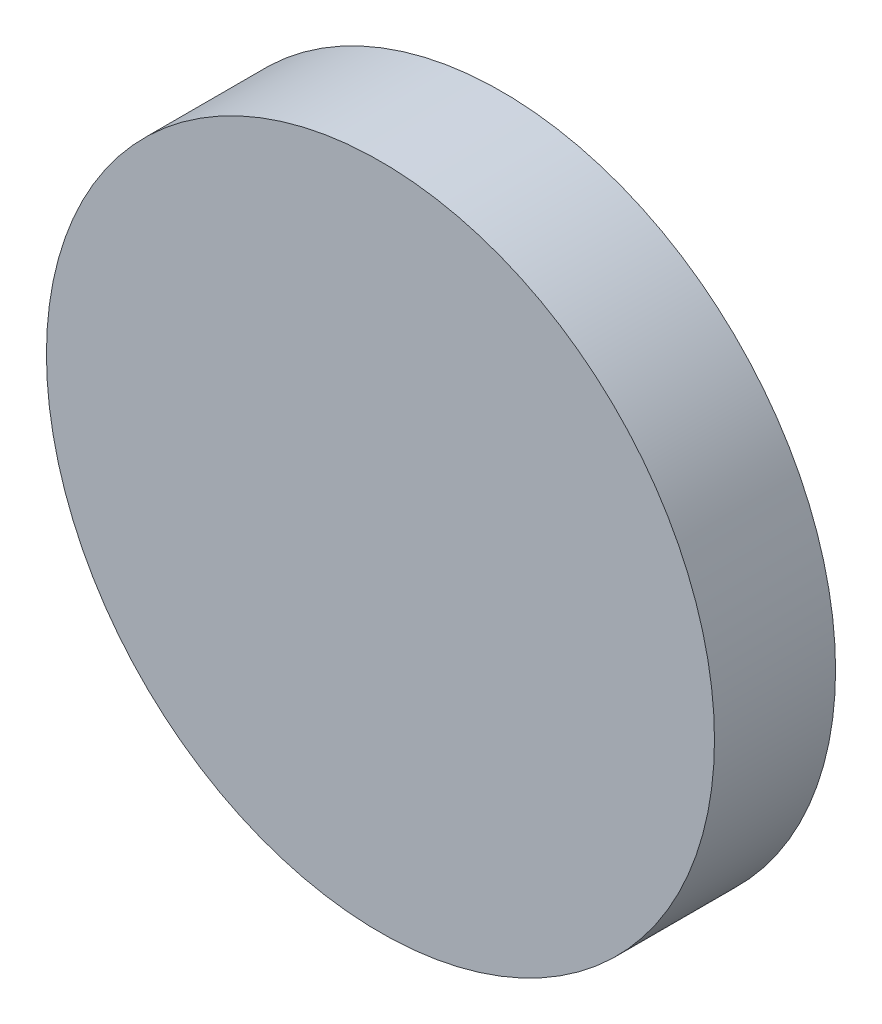
ISO-10303-21;
HEADER;
FILE_DESCRIPTION(('STEP AP214'),'2;1');
FILE_NAME('part.step','',(''),(''),'','','');
FILE_SCHEMA(('AUTOMOTIVE_DESIGN { 1 0 10303 214 1 1 1 1 }'));
ENDSEC;
DATA;
#1=APPLICATION_CONTEXT('core data for automotive mechanical design processes');
#2=APPLICATION_PROTOCOL_DEFINITION('international standard','automotive_design',2000,#1);
#3=PRODUCT_CONTEXT('',#1,'mechanical');
#4=PRODUCT('Part','Part','',(#3));
#5=PRODUCT_RELATED_PRODUCT_CATEGORY('part','',(#4));
#6=PRODUCT_DEFINITION_FORMATION('','',#4);
#7=PRODUCT_DEFINITION_CONTEXT('part definition',#1,'design');
#8=PRODUCT_DEFINITION('design','',#6,#7);
#9=PRODUCT_DEFINITION_SHAPE('','',#8);
#10=(LENGTH_UNIT() NAMED_UNIT(*) SI_UNIT(.MILLI.,.METRE.));
#11=(NAMED_UNIT(*) PLANE_ANGLE_UNIT() SI_UNIT($,.RADIAN.));
#12=(NAMED_UNIT(*) SI_UNIT($,.STERADIAN.) SOLID_ANGLE_UNIT());
#13=UNCERTAINTY_MEASURE_WITH_UNIT(LENGTH_MEASURE(1.E-05),#10,'distance_accuracy_value','');
#14=(GEOMETRIC_REPRESENTATION_CONTEXT(3) GLOBAL_UNCERTAINTY_ASSIGNED_CONTEXT((#13)) GLOBAL_UNIT_ASSIGNED_CONTEXT((#10,
#11,#12)) REPRESENTATION_CONTEXT('',''));
#15=CARTESIAN_POINT('',(0.,0.,0.));
#16=DIRECTION('',(0.,0.,1.));
#17=DIRECTION('',(1.,0.,0.));
#18=AXIS2_PLACEMENT_3D('',#15,#16,#17);
#19=CARTESIAN_POINT('',(-6.39539027108266,2.92873012414066,10.));
#20=DIRECTION('',(0.,0.,-1.));
#21=DIRECTION('',(-1.,0.,0.));
#22=AXIS2_PLACEMENT_3D('',#19,#20,#21);
#23=CYLINDRICAL_SURFACE('',#22,27.5857825998471);
#24=CARTESIAN_POINT('',(-6.39539027108266,2.92873012414066,10.));
#25=DIRECTION('',(0.,0.,1.));
#26=DIRECTION('',(1.,0.,0.));
#27=AXIS2_PLACEMENT_3D('',#24,#25,#26);
#28=CIRCLE('',#27,27.5857825998471);
#29=CARTESIAN_POINT('',(21.1903923287644,2.92873012414066,10.));
#30=VERTEX_POINT('',#29);
#31=EDGE_CURVE('E10',#30,#30,#28,.T.);
#32=ORIENTED_EDGE('',*,*,#31,.F.);
#33=EDGE_LOOP('',(#32));
#34=FACE_BOUND('',#33,.T.);
#35=CARTESIAN_POINT('',(-6.39539027108266,2.92873012414066,0.));
#36=DIRECTION('',(0.,0.,1.));
#37=DIRECTION('',(1.,0.,0.));
#38=AXIS2_PLACEMENT_3D('',#35,#36,#37);
#39=CIRCLE('',#38,27.5857825998471);
#40=CARTESIAN_POINT('',(21.1903923287644,2.92873012414066,0.));
#41=VERTEX_POINT('',#40);
#42=EDGE_CURVE('E40',#41,#41,#39,.T.);
#43=ORIENTED_EDGE('',*,*,#42,.T.);
#44=EDGE_LOOP('',(#43));
#45=FACE_BOUND('',#44,.T.);
#46=ADVANCED_FACE('F37',(#34,#45),#23,.T.);
#47=CARTESIAN_POINT('',(-6.39539027108266,2.92873012414066,10.));
#48=DIRECTION('',(0.,0.,1.));
#49=DIRECTION('',(1.,0.,0.));
#50=AXIS2_PLACEMENT_3D('',#47,#48,#49);
#51=PLANE('',#50);
#52=ORIENTED_EDGE('',*,*,#31,.T.);
#53=EDGE_LOOP('',(#52));
#54=FACE_BOUND('',#53,.T.);
#55=ADVANCED_FACE('F52',(#54),#51,.T.);
#56=CARTESIAN_POINT('',(-6.39539027108266,2.92873012414066,0.));
#57=DIRECTION('',(0.,0.,1.));
#58=DIRECTION('',(1.,0.,0.));
#59=AXIS2_PLACEMENT_3D('',#56,#57,#58);
#60=PLANE('',#59);
#61=ORIENTED_EDGE('',*,*,#42,.F.);
#62=EDGE_LOOP('',(#61));
#63=FACE_BOUND('',#62,.T.);
#64=ADVANCED_FACE('F50',(#63),#60,.F.);
#65=CLOSED_SHELL('',(#46,#55,#64));
#66=MANIFOLD_SOLID_BREP('B2',#65);
#67=ADVANCED_BREP_SHAPE_REPRESENTATION('',(#18,#66),#14);
#68=SHAPE_DEFINITION_REPRESENTATION(#9,#67);
ENDSEC;
END-ISO-10303-21;
